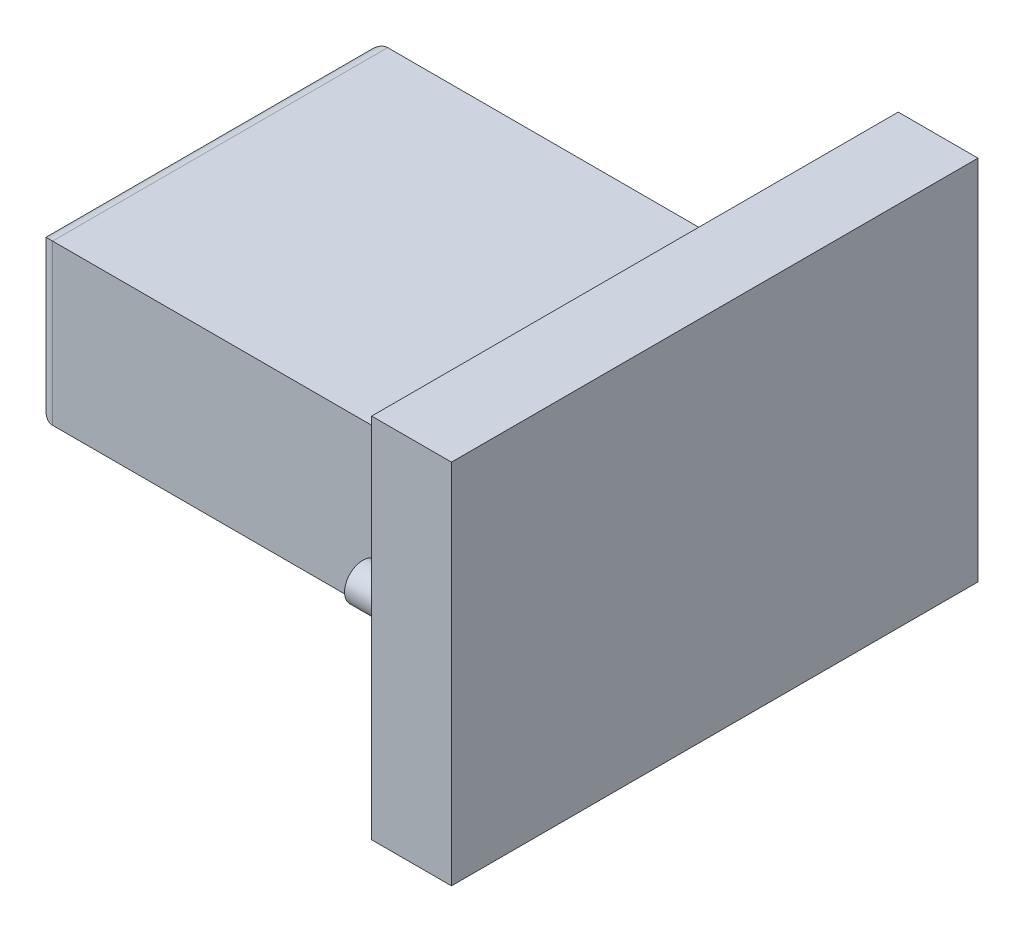
ISO-10303-21;
HEADER;
FILE_DESCRIPTION(('STEP AP214'),'2;1');
FILE_NAME('part.step','',(''),(''),'','','');
FILE_SCHEMA(('AUTOMOTIVE_DESIGN { 1 0 10303 214 1 1 1 1 }'));
ENDSEC;
DATA;
#1=APPLICATION_CONTEXT('core data for automotive mechanical design processes');
#2=APPLICATION_PROTOCOL_DEFINITION('international standard','automotive_design',2000,#1);
#3=PRODUCT_CONTEXT('',#1,'mechanical');
#4=PRODUCT('Part','Part','',(#3));
#5=PRODUCT_RELATED_PRODUCT_CATEGORY('part','',(#4));
#6=PRODUCT_DEFINITION_FORMATION('','',#4);
#7=PRODUCT_DEFINITION_CONTEXT('part definition',#1,'design');
#8=PRODUCT_DEFINITION('design','',#6,#7);
#9=PRODUCT_DEFINITION_SHAPE('','',#8);
#10=(LENGTH_UNIT() NAMED_UNIT(*) SI_UNIT(.MILLI.,.METRE.));
#11=(NAMED_UNIT(*) PLANE_ANGLE_UNIT() SI_UNIT($,.RADIAN.));
#12=(NAMED_UNIT(*) SI_UNIT($,.STERADIAN.) SOLID_ANGLE_UNIT());
#13=UNCERTAINTY_MEASURE_WITH_UNIT(LENGTH_MEASURE(1.E-05),#10,'distance_accuracy_value','');
#14=(GEOMETRIC_REPRESENTATION_CONTEXT(3) GLOBAL_UNCERTAINTY_ASSIGNED_CONTEXT((#13)) GLOBAL_UNIT_ASSIGNED_CONTEXT((#10,
#11,#12)) REPRESENTATION_CONTEXT('',''));
#15=CARTESIAN_POINT('',(0.,0.,0.));
#16=DIRECTION('',(0.,0.,1.));
#17=DIRECTION('',(1.,0.,0.));
#18=AXIS2_PLACEMENT_3D('',#15,#16,#17);
#19=CARTESIAN_POINT('',(5.,0.,0.));
#20=DIRECTION('',(0.,0.,-1.));
#21=DIRECTION('',(-1.,0.,0.));
#22=AXIS2_PLACEMENT_3D('',#19,#20,#21);
#23=PLANE('',#22);
#24=DIRECTION('',(0.,-1.,0.));
#25=VECTOR('',#24,1.);
#26=CARTESIAN_POINT('',(0.,0.,0.));
#27=LINE('',#26,#25);
#28=CARTESIAN_POINT('',(0.,23.,0.));
#29=VERTEX_POINT('',#28);
#30=CARTESIAN_POINT('',(0.,0.,0.));
#31=VERTEX_POINT('',#30);
#32=EDGE_CURVE('E152',#29,#31,#27,.T.);
#33=ORIENTED_EDGE('',*,*,#32,.T.);
#34=DIRECTION('',(-1.,0.,0.));
#35=VECTOR('',#34,1.);
#36=CARTESIAN_POINT('',(5.,0.,0.));
#37=LINE('',#36,#35);
#38=CARTESIAN_POINT('',(5.,0.,0.));
#39=VERTEX_POINT('',#38);
#40=EDGE_CURVE('E179',#39,#31,#37,.T.);
#41=ORIENTED_EDGE('',*,*,#40,.F.);
#42=DIRECTION('',(0.,-1.,0.));
#43=VECTOR('',#42,1.);
#44=CARTESIAN_POINT('',(5.,0.,0.));
#45=LINE('',#44,#43);
#46=CARTESIAN_POINT('',(5.,23.,0.));
#47=VERTEX_POINT('',#46);
#48=EDGE_CURVE('E153',#47,#39,#45,.T.);
#49=ORIENTED_EDGE('',*,*,#48,.F.);
#50=DIRECTION('',(-1.,0.,0.));
#51=VECTOR('',#50,1.);
#52=CARTESIAN_POINT('',(5.,23.,0.));
#53=LINE('',#52,#51);
#54=EDGE_CURVE('E163',#47,#29,#53,.T.);
#55=ORIENTED_EDGE('',*,*,#54,.T.);
#56=EDGE_LOOP('',(#33,#41,#49,#55));
#57=FACE_BOUND('',#56,.T.);
#58=ADVANCED_FACE('F45',(#57),#23,.F.);
#59=CARTESIAN_POINT('',(5.,0.,0.));
#60=DIRECTION('',(0.,1.,0.));
#61=DIRECTION('',(0.,0.,1.));
#62=AXIS2_PLACEMENT_3D('',#59,#60,#61);
#63=PLANE('',#62);
#64=DIRECTION('',(0.,0.,-1.));
#65=VECTOR('',#64,1.);
#66=CARTESIAN_POINT('',(0.,0.,0.));
#67=LINE('',#66,#65);
#68=CARTESIAN_POINT('',(0.,0.,-33.));
#69=VERTEX_POINT('',#68);
#70=EDGE_CURVE('E166',#31,#69,#67,.T.);
#71=ORIENTED_EDGE('',*,*,#70,.T.);
#72=DIRECTION('',(-1.,0.,0.));
#73=VECTOR('',#72,1.);
#74=CARTESIAN_POINT('',(5.,0.,-33.));
#75=LINE('',#74,#73);
#76=CARTESIAN_POINT('',(5.,0.,-33.));
#77=VERTEX_POINT('',#76);
#78=EDGE_CURVE('E176',#77,#69,#75,.T.);
#79=ORIENTED_EDGE('',*,*,#78,.F.);
#80=DIRECTION('',(0.,0.,-1.));
#81=VECTOR('',#80,1.);
#82=CARTESIAN_POINT('',(5.,0.,0.));
#83=LINE('',#82,#81);
#84=EDGE_CURVE('E156',#39,#77,#83,.T.);
#85=ORIENTED_EDGE('',*,*,#84,.F.);
#86=ORIENTED_EDGE('',*,*,#40,.T.);
#87=EDGE_LOOP('',(#71,#79,#85,#86));
#88=FACE_BOUND('',#87,.T.);
#89=ADVANCED_FACE('F253',(#88),#63,.F.);
#90=CARTESIAN_POINT('',(5.,0.,-33.));
#91=DIRECTION('',(0.,0.,1.));
#92=DIRECTION('',(1.,0.,0.));
#93=AXIS2_PLACEMENT_3D('',#90,#91,#92);
#94=PLANE('',#93);
#95=DIRECTION('',(0.,1.,0.));
#96=VECTOR('',#95,1.);
#97=CARTESIAN_POINT('',(0.,0.,-33.));
#98=LINE('',#97,#96);
#99=CARTESIAN_POINT('',(0.,23.,-33.));
#100=VERTEX_POINT('',#99);
#101=EDGE_CURVE('E168',#69,#100,#98,.T.);
#102=ORIENTED_EDGE('',*,*,#101,.T.);
#103=DIRECTION('',(-1.,0.,0.));
#104=VECTOR('',#103,1.);
#105=CARTESIAN_POINT('',(5.,23.,-33.));
#106=LINE('',#105,#104);
#107=CARTESIAN_POINT('',(5.,23.,-33.));
#108=VERTEX_POINT('',#107);
#109=EDGE_CURVE('E173',#108,#100,#106,.T.);
#110=ORIENTED_EDGE('',*,*,#109,.F.);
#111=DIRECTION('',(0.,1.,0.));
#112=VECTOR('',#111,1.);
#113=CARTESIAN_POINT('',(5.,0.,-33.));
#114=LINE('',#113,#112);
#115=EDGE_CURVE('E159',#77,#108,#114,.T.);
#116=ORIENTED_EDGE('',*,*,#115,.F.);
#117=ORIENTED_EDGE('',*,*,#78,.T.);
#118=EDGE_LOOP('',(#102,#110,#116,#117));
#119=FACE_BOUND('',#118,.T.);
#120=ADVANCED_FACE('F259',(#119),#94,.F.);
#121=CARTESIAN_POINT('',(5.,23.,0.));
#122=DIRECTION('',(0.,-1.,0.));
#123=DIRECTION('',(0.,0.,-1.));
#124=AXIS2_PLACEMENT_3D('',#121,#122,#123);
#125=PLANE('',#124);
#126=DIRECTION('',(0.,0.,1.));
#127=VECTOR('',#126,1.);
#128=CARTESIAN_POINT('',(0.,23.,0.));
#129=LINE('',#128,#127);
#130=EDGE_CURVE('E157',#100,#29,#129,.T.);
#131=ORIENTED_EDGE('',*,*,#130,.T.);
#132=ORIENTED_EDGE('',*,*,#54,.F.);
#133=DIRECTION('',(0.,0.,1.));
#134=VECTOR('',#133,1.);
#135=CARTESIAN_POINT('',(5.,23.,0.));
#136=LINE('',#135,#134);
#137=EDGE_CURVE('E161',#108,#47,#136,.T.);
#138=ORIENTED_EDGE('',*,*,#137,.F.);
#139=ORIENTED_EDGE('',*,*,#109,.T.);
#140=EDGE_LOOP('',(#131,#132,#138,#139));
#141=FACE_BOUND('',#140,.T.);
#142=ADVANCED_FACE('F308',(#141),#125,.F.);
#143=CARTESIAN_POINT('',(5.,0.,0.));
#144=DIRECTION('',(-1.,0.,0.));
#145=DIRECTION('',(0.,0.,1.));
#146=AXIS2_PLACEMENT_3D('',#143,#144,#145);
#147=PLANE('',#146);
#148=ORIENTED_EDGE('',*,*,#48,.T.);
#149=ORIENTED_EDGE('',*,*,#84,.T.);
#150=ORIENTED_EDGE('',*,*,#115,.T.);
#151=ORIENTED_EDGE('',*,*,#137,.T.);
#152=EDGE_LOOP('',(#148,#149,#150,#151));
#153=FACE_BOUND('',#152,.T.);
#154=ADVANCED_FACE('F305',(#153),#147,.F.);
#155=CARTESIAN_POINT('',(0.,0.,0.));
#156=DIRECTION('',(-1.,0.,0.));
#157=DIRECTION('',(0.,0.,1.));
#158=AXIS2_PLACEMENT_3D('',#155,#156,#157);
#159=PLANE('',#158);
#160=CARTESIAN_POINT('',(0.,11.5,-30.75));
#161=DIRECTION('',(-1.,0.,0.));
#162=DIRECTION('',(0.,0.,1.));
#163=AXIS2_PLACEMENT_3D('',#160,#161,#162);
#164=CIRCLE('',#163,1.4);
#165=CARTESIAN_POINT('',(0.,11.5,-29.35));
#166=VERTEX_POINT('',#165);
#167=EDGE_CURVE('E53',#166,#166,#164,.F.);
#168=ORIENTED_EDGE('',*,*,#167,.T.);
#169=EDGE_LOOP('',(#168));
#170=FACE_BOUND('',#169,.T.);
#171=CARTESIAN_POINT('',(0.,11.5,-2.25));
#172=DIRECTION('',(-1.,0.,0.));
#173=DIRECTION('',(0.,0.,1.));
#174=AXIS2_PLACEMENT_3D('',#171,#172,#173);
#175=CIRCLE('',#174,1.4);
#176=CARTESIAN_POINT('',(0.,11.5,-0.850000000000001));
#177=VERTEX_POINT('',#176);
#178=EDGE_CURVE('E211',#177,#177,#175,.F.);
#179=ORIENTED_EDGE('',*,*,#178,.T.);
#180=EDGE_LOOP('',(#179));
#181=FACE_BOUND('',#180,.T.);
#182=DIRECTION('',(0.,-1.,0.));
#183=VECTOR('',#182,1.);
#184=CARTESIAN_POINT('',(0.,6.5,-27.));
#185=LINE('',#184,#183);
#186=CARTESIAN_POINT('',(0.,16.5,-27.));
#187=VERTEX_POINT('',#186);
#188=CARTESIAN_POINT('',(0.,6.5,-27.));
#189=VERTEX_POINT('',#188);
#190=EDGE_CURVE('E141',#187,#189,#185,.T.);
#191=ORIENTED_EDGE('',*,*,#190,.F.);
#192=DIRECTION('',(0.,0.,-1.));
#193=VECTOR('',#192,1.);
#194=CARTESIAN_POINT('',(0.,16.5,-27.));
#195=LINE('',#194,#193);
#196=CARTESIAN_POINT('',(0.,16.5,-6.));
#197=VERTEX_POINT('',#196);
#198=EDGE_CURVE('E138',#197,#187,#195,.T.);
#199=ORIENTED_EDGE('',*,*,#198,.F.);
#200=DIRECTION('',(0.,1.,0.));
#201=VECTOR('',#200,1.);
#202=CARTESIAN_POINT('',(0.,6.5,-6.));
#203=LINE('',#202,#201);
#204=CARTESIAN_POINT('',(0.,6.5,-6.));
#205=VERTEX_POINT('',#204);
#206=EDGE_CURVE('E124',#205,#197,#203,.T.);
#207=ORIENTED_EDGE('',*,*,#206,.F.);
#208=DIRECTION('',(0.,0.,1.));
#209=VECTOR('',#208,1.);
#210=CARTESIAN_POINT('',(0.,6.5,-27.));
#211=LINE('',#210,#209);
#212=EDGE_CURVE('E135',#189,#205,#211,.T.);
#213=ORIENTED_EDGE('',*,*,#212,.F.);
#214=EDGE_LOOP('',(#191,#199,#207,#213));
#215=FACE_BOUND('',#214,.T.);
#216=ORIENTED_EDGE('',*,*,#32,.F.);
#217=ORIENTED_EDGE('',*,*,#130,.F.);
#218=ORIENTED_EDGE('',*,*,#101,.F.);
#219=ORIENTED_EDGE('',*,*,#70,.F.);
#220=EDGE_LOOP('',(#216,#217,#218,#219));
#221=FACE_BOUND('',#220,.T.);
#222=ADVANCED_FACE('F133',(#170,#181,#215,#221),#159,.T.);
#223=CARTESIAN_POINT('',(-27.,6.5,-27.));
#224=DIRECTION('',(0.,0.,1.));
#225=DIRECTION('',(1.,0.,0.));
#226=AXIS2_PLACEMENT_3D('',#223,#224,#225);
#227=PLANE('',#226);
#228=DIRECTION('',(1.,0.,0.));
#229=VECTOR('',#228,1.);
#230=CARTESIAN_POINT('',(-27.,6.5,-27.));
#231=LINE('',#230,#229);
#232=CARTESIAN_POINT('',(-26.,6.5,-27.));
#233=VERTEX_POINT('',#232);
#234=EDGE_CURVE('E126',#233,#189,#231,.T.);
#235=ORIENTED_EDGE('',*,*,#234,.F.);
#236=DIRECTION('',(0.,-1.,0.));
#237=VECTOR('',#236,1.);
#238=CARTESIAN_POINT('',(-26.,6.5,-27.));
#239=LINE('',#238,#237);
#240=CARTESIAN_POINT('',(-26.,16.5,-27.));
#241=VERTEX_POINT('',#240);
#242=EDGE_CURVE('E196',#233,#241,#239,.F.);
#243=ORIENTED_EDGE('',*,*,#242,.T.);
#244=DIRECTION('',(1.,0.,0.));
#245=VECTOR('',#244,1.);
#246=CARTESIAN_POINT('',(-27.,16.5,-27.));
#247=LINE('',#246,#245);
#248=EDGE_CURVE('E148',#241,#187,#247,.T.);
#249=ORIENTED_EDGE('',*,*,#248,.T.);
#250=ORIENTED_EDGE('',*,*,#190,.T.);
#251=EDGE_LOOP('',(#235,#243,#249,#250));
#252=FACE_BOUND('',#251,.T.);
#253=ADVANCED_FACE('F288',(#252),#227,.F.);
#254=CARTESIAN_POINT('',(-27.,6.5,-27.));
#255=DIRECTION('',(0.,1.,0.));
#256=DIRECTION('',(0.,0.,1.));
#257=AXIS2_PLACEMENT_3D('',#254,#255,#256);
#258=PLANE('',#257);
#259=DIRECTION('',(1.,0.,0.));
#260=VECTOR('',#259,1.);
#261=CARTESIAN_POINT('',(-27.,6.5,-6.));
#262=LINE('',#261,#260);
#263=CARTESIAN_POINT('',(-26.,6.5,-6.));
#264=VERTEX_POINT('',#263);
#265=EDGE_CURVE('E121',#264,#205,#262,.T.);
#266=ORIENTED_EDGE('',*,*,#265,.F.);
#267=DIRECTION('',(0.,0.,1.));
#268=VECTOR('',#267,1.);
#269=CARTESIAN_POINT('',(-26.,6.5,-27.));
#270=LINE('',#269,#268);
#271=EDGE_CURVE('E60',#264,#233,#270,.F.);
#272=ORIENTED_EDGE('',*,*,#271,.T.);
#273=ORIENTED_EDGE('',*,*,#234,.T.);
#274=ORIENTED_EDGE('',*,*,#212,.T.);
#275=EDGE_LOOP('',(#266,#272,#273,#274));
#276=FACE_BOUND('',#275,.T.);
#277=ADVANCED_FACE('F140',(#276),#258,.F.);
#278=CARTESIAN_POINT('',(-27.,6.5,-6.));
#279=DIRECTION('',(0.,0.,-1.));
#280=DIRECTION('',(-1.,0.,0.));
#281=AXIS2_PLACEMENT_3D('',#278,#279,#280);
#282=PLANE('',#281);
#283=DIRECTION('',(1.,0.,0.));
#284=VECTOR('',#283,1.);
#285=CARTESIAN_POINT('',(-27.,16.5,-6.));
#286=LINE('',#285,#284);
#287=CARTESIAN_POINT('',(-26.,16.5,-6.));
#288=VERTEX_POINT('',#287);
#289=EDGE_CURVE('E127',#288,#197,#286,.T.);
#290=ORIENTED_EDGE('',*,*,#289,.F.);
#291=DIRECTION('',(0.,1.,0.));
#292=VECTOR('',#291,1.);
#293=CARTESIAN_POINT('',(-26.,6.5,-6.));
#294=LINE('',#293,#292);
#295=EDGE_CURVE('E68',#288,#264,#294,.F.);
#296=ORIENTED_EDGE('',*,*,#295,.T.);
#297=ORIENTED_EDGE('',*,*,#265,.T.);
#298=ORIENTED_EDGE('',*,*,#206,.T.);
#299=EDGE_LOOP('',(#290,#296,#297,#298));
#300=FACE_BOUND('',#299,.T.);
#301=ADVANCED_FACE('F123',(#300),#282,.F.);
#302=CARTESIAN_POINT('',(-27.,16.5,-27.));
#303=DIRECTION('',(0.,-1.,0.));
#304=DIRECTION('',(0.,0.,-1.));
#305=AXIS2_PLACEMENT_3D('',#302,#303,#304);
#306=PLANE('',#305);
#307=ORIENTED_EDGE('',*,*,#248,.F.);
#308=DIRECTION('',(0.,0.,-1.));
#309=VECTOR('',#308,1.);
#310=CARTESIAN_POINT('',(-26.,16.5,-27.));
#311=LINE('',#310,#309);
#312=EDGE_CURVE('E191',#241,#288,#311,.F.);
#313=ORIENTED_EDGE('',*,*,#312,.T.);
#314=ORIENTED_EDGE('',*,*,#289,.T.);
#315=ORIENTED_EDGE('',*,*,#198,.T.);
#316=EDGE_LOOP('',(#307,#313,#314,#315));
#317=FACE_BOUND('',#316,.T.);
#318=ADVANCED_FACE('F278',(#317),#306,.F.);
#319=CARTESIAN_POINT('',(-27.,0.,0.));
#320=DIRECTION('',(1.,0.,0.));
#321=DIRECTION('',(0.,0.,-1.));
#322=AXIS2_PLACEMENT_3D('',#319,#320,#321);
#323=PLANE('',#322);
#324=DIRECTION('',(0.,1.,0.));
#325=VECTOR('',#324,1.);
#326=CARTESIAN_POINT('',(-27.,0.,-7.));
#327=LINE('',#326,#325);
#328=CARTESIAN_POINT('',(-27.,7.5,-7.));
#329=VERTEX_POINT('',#328);
#330=CARTESIAN_POINT('',(-27.,15.5,-7.));
#331=VERTEX_POINT('',#330);
#332=EDGE_CURVE('E186',#329,#331,#327,.T.);
#333=ORIENTED_EDGE('',*,*,#332,.T.);
#334=DIRECTION('',(0.,0.,-1.));
#335=VECTOR('',#334,1.);
#336=CARTESIAN_POINT('',(-27.,15.5,0.));
#337=LINE('',#336,#335);
#338=CARTESIAN_POINT('',(-27.,15.5,-26.));
#339=VERTEX_POINT('',#338);
#340=EDGE_CURVE('E188',#331,#339,#337,.T.);
#341=ORIENTED_EDGE('',*,*,#340,.T.);
#342=DIRECTION('',(0.,-1.,0.));
#343=VECTOR('',#342,1.);
#344=CARTESIAN_POINT('',(-27.,0.,-26.));
#345=LINE('',#344,#343);
#346=CARTESIAN_POINT('',(-27.,7.5,-26.));
#347=VERTEX_POINT('',#346);
#348=EDGE_CURVE('E182',#339,#347,#345,.T.);
#349=ORIENTED_EDGE('',*,*,#348,.T.);
#350=DIRECTION('',(0.,0.,1.));
#351=VECTOR('',#350,1.);
#352=CARTESIAN_POINT('',(-27.,7.5,0.));
#353=LINE('',#352,#351);
#354=EDGE_CURVE('E184',#347,#329,#353,.T.);
#355=ORIENTED_EDGE('',*,*,#354,.T.);
#356=EDGE_LOOP('',(#333,#341,#349,#355));
#357=FACE_BOUND('',#356,.T.);
#358=ADVANCED_FACE('F273',(#357),#323,.F.);
#359=CARTESIAN_POINT('',(-26.,7.5,0.));
#360=DIRECTION('',(0.,0.,1.));
#361=DIRECTION('',(1.,0.,0.));
#362=AXIS2_PLACEMENT_3D('',#359,#360,#361);
#363=CYLINDRICAL_SURFACE('',#362,1.);
#364=CARTESIAN_POINT('',(-26.,7.5,-26.));
#365=DIRECTION('',(0.,-0.707106781186547,0.707106781186547));
#366=DIRECTION('',(0.,-0.707106781186547,-0.707106781186547));
#367=AXIS2_PLACEMENT_3D('',#364,#365,#366);
#368=ELLIPSE('',#367,1.41421356237309,1.);
#369=EDGE_CURVE('E204',#233,#347,#368,.F.);
#370=ORIENTED_EDGE('',*,*,#369,.F.);
#371=ORIENTED_EDGE('',*,*,#271,.F.);
#372=CARTESIAN_POINT('',(-26.,7.5,-7.));
#373=DIRECTION('',(0.,0.707106781186547,0.707106781186547));
#374=DIRECTION('',(0.,-0.707106781186547,0.707106781186547));
#375=AXIS2_PLACEMENT_3D('',#372,#373,#374);
#376=ELLIPSE('',#375,1.41421356237309,1.);
#377=EDGE_CURVE('E143',#329,#264,#376,.T.);
#378=ORIENTED_EDGE('',*,*,#377,.F.);
#379=ORIENTED_EDGE('',*,*,#354,.F.);
#380=EDGE_LOOP('',(#370,#371,#378,#379));
#381=FACE_BOUND('',#380,.T.);
#382=ADVANCED_FACE('F270',(#381),#363,.T.);
#383=CARTESIAN_POINT('',(-26.,0.,-7.));
#384=DIRECTION('',(0.,1.,0.));
#385=DIRECTION('',(0.,0.,1.));
#386=AXIS2_PLACEMENT_3D('',#383,#384,#385);
#387=CYLINDRICAL_SURFACE('',#386,1.);
#388=ORIENTED_EDGE('',*,*,#377,.T.);
#389=ORIENTED_EDGE('',*,*,#295,.F.);
#390=CARTESIAN_POINT('',(-26.,15.5,-7.));
#391=DIRECTION('',(0.,0.707106781186547,-0.707106781186547));
#392=DIRECTION('',(0.,0.707106781186547,0.707106781186547));
#393=AXIS2_PLACEMENT_3D('',#390,#391,#392);
#394=ELLIPSE('',#393,1.41421356237309,1.);
#395=EDGE_CURVE('E201',#331,#288,#394,.T.);
#396=ORIENTED_EDGE('',*,*,#395,.F.);
#397=ORIENTED_EDGE('',*,*,#332,.F.);
#398=EDGE_LOOP('',(#388,#389,#396,#397));
#399=FACE_BOUND('',#398,.T.);
#400=ADVANCED_FACE('F266',(#399),#387,.T.);
#401=CARTESIAN_POINT('',(-26.,0.,-26.));
#402=DIRECTION('',(0.,-1.,0.));
#403=DIRECTION('',(0.,0.,-1.));
#404=AXIS2_PLACEMENT_3D('',#401,#402,#403);
#405=CYLINDRICAL_SURFACE('',#404,1.);
#406=ORIENTED_EDGE('',*,*,#369,.T.);
#407=ORIENTED_EDGE('',*,*,#348,.F.);
#408=CARTESIAN_POINT('',(-26.,15.5,-26.));
#409=DIRECTION('',(0.,-0.707106781186547,-0.707106781186547));
#410=DIRECTION('',(0.,-0.707106781186547,0.707106781186547));
#411=AXIS2_PLACEMENT_3D('',#408,#409,#410);
#412=ELLIPSE('',#411,1.41421356237309,1.);
#413=EDGE_CURVE('E199',#241,#339,#412,.F.);
#414=ORIENTED_EDGE('',*,*,#413,.F.);
#415=ORIENTED_EDGE('',*,*,#242,.F.);
#416=EDGE_LOOP('',(#406,#407,#414,#415));
#417=FACE_BOUND('',#416,.T.);
#418=ADVANCED_FACE('F248',(#417),#405,.T.);
#419=CARTESIAN_POINT('',(-26.,15.5,0.));
#420=DIRECTION('',(0.,0.,-1.));
#421=DIRECTION('',(-1.,0.,0.));
#422=AXIS2_PLACEMENT_3D('',#419,#420,#421);
#423=CYLINDRICAL_SURFACE('',#422,1.);
#424=ORIENTED_EDGE('',*,*,#395,.T.);
#425=ORIENTED_EDGE('',*,*,#312,.F.);
#426=ORIENTED_EDGE('',*,*,#413,.T.);
#427=ORIENTED_EDGE('',*,*,#340,.F.);
#428=EDGE_LOOP('',(#424,#425,#426,#427));
#429=FACE_BOUND('',#428,.T.);
#430=ADVANCED_FACE('F240',(#429),#423,.T.);
#431=CARTESIAN_POINT('',(-2.8,11.5,-2.25));
#432=DIRECTION('',(1.,0.,0.));
#433=DIRECTION('',(0.,0.,-1.));
#434=AXIS2_PLACEMENT_3D('',#431,#432,#433);
#435=CYLINDRICAL_SURFACE('',#434,1.15);
#436=CARTESIAN_POINT('',(-0.25,11.5,-2.25));
#437=DIRECTION('',(-1.,0.,0.));
#438=DIRECTION('',(0.,0.,1.));
#439=AXIS2_PLACEMENT_3D('',#436,#437,#438);
#440=CIRCLE('',#439,1.15);
#441=CARTESIAN_POINT('',(-0.25,11.5,-1.1));
#442=VERTEX_POINT('',#441);
#443=EDGE_CURVE('E13',#442,#442,#440,.T.);
#444=ORIENTED_EDGE('',*,*,#443,.T.);
#445=EDGE_LOOP('',(#444));
#446=FACE_BOUND('',#445,.T.);
#447=CARTESIAN_POINT('',(-2.8,11.5,-2.25));
#448=DIRECTION('',(-1.,0.,0.));
#449=DIRECTION('',(0.,0.,1.));
#450=AXIS2_PLACEMENT_3D('',#447,#448,#449);
#451=CIRCLE('',#450,1.15);
#452=CARTESIAN_POINT('',(-2.8,11.5,-1.1));
#453=VERTEX_POINT('',#452);
#454=EDGE_CURVE('E202',#453,#453,#451,.T.);
#455=ORIENTED_EDGE('',*,*,#454,.F.);
#456=EDGE_LOOP('',(#455));
#457=FACE_BOUND('',#456,.T.);
#458=ADVANCED_FACE('F238',(#446,#457),#435,.T.);
#459=CARTESIAN_POINT('',(-2.8,11.5,-2.25));
#460=DIRECTION('',(-1.,0.,0.));
#461=DIRECTION('',(0.,0.,1.));
#462=AXIS2_PLACEMENT_3D('',#459,#460,#461);
#463=PLANE('',#462);
#464=ORIENTED_EDGE('',*,*,#454,.T.);
#465=EDGE_LOOP('',(#464));
#466=FACE_BOUND('',#465,.T.);
#467=ADVANCED_FACE('F227',(#466),#463,.T.);
#468=CARTESIAN_POINT('',(-2.8,11.5,-30.75));
#469=DIRECTION('',(1.,0.,0.));
#470=DIRECTION('',(0.,0.,-1.));
#471=AXIS2_PLACEMENT_3D('',#468,#469,#470);
#472=CYLINDRICAL_SURFACE('',#471,1.15);
#473=CARTESIAN_POINT('',(-0.25,11.5,-30.75));
#474=DIRECTION('',(-1.,0.,0.));
#475=DIRECTION('',(0.,0.,1.));
#476=AXIS2_PLACEMENT_3D('',#473,#474,#475);
#477=CIRCLE('',#476,1.15);
#478=CARTESIAN_POINT('',(-0.25,11.5,-29.6));
#479=VERTEX_POINT('',#478);
#480=EDGE_CURVE('E198',#479,#479,#477,.T.);
#481=ORIENTED_EDGE('',*,*,#480,.T.);
#482=EDGE_LOOP('',(#481));
#483=FACE_BOUND('',#482,.T.);
#484=CARTESIAN_POINT('',(-2.8,11.5,-30.75));
#485=DIRECTION('',(-1.,0.,0.));
#486=DIRECTION('',(0.,0.,1.));
#487=AXIS2_PLACEMENT_3D('',#484,#485,#486);
#488=CIRCLE('',#487,1.15);
#489=CARTESIAN_POINT('',(-2.8,11.5,-29.6));
#490=VERTEX_POINT('',#489);
#491=EDGE_CURVE('E231',#490,#490,#488,.T.);
#492=ORIENTED_EDGE('',*,*,#491,.F.);
#493=EDGE_LOOP('',(#492));
#494=FACE_BOUND('',#493,.T.);
#495=ADVANCED_FACE('F224',(#483,#494),#472,.T.);
#496=CARTESIAN_POINT('',(-2.8,11.5,-30.75));
#497=DIRECTION('',(-1.,0.,0.));
#498=DIRECTION('',(0.,0.,1.));
#499=AXIS2_PLACEMENT_3D('',#496,#497,#498);
#500=PLANE('',#499);
#501=ORIENTED_EDGE('',*,*,#491,.T.);
#502=EDGE_LOOP('',(#501));
#503=FACE_BOUND('',#502,.T.);
#504=ADVANCED_FACE('F221',(#503),#500,.T.);
#505=CARTESIAN_POINT('',(-0.25,11.5,-30.75));
#506=DIRECTION('',(-1.,0.,0.));
#507=DIRECTION('',(0.,0.,1.));
#508=AXIS2_PLACEMENT_3D('',#505,#506,#507);
#509=TOROIDAL_SURFACE('',#508,1.4,0.25);
#510=ORIENTED_EDGE('',*,*,#167,.F.);
#511=EDGE_LOOP('',(#510));
#512=FACE_BOUND('',#511,.T.);
#513=ORIENTED_EDGE('',*,*,#480,.F.);
#514=EDGE_LOOP('',(#513));
#515=FACE_BOUND('',#514,.T.);
#516=ADVANCED_FACE('F218',(#512,#515),#509,.F.);
#517=CARTESIAN_POINT('',(-0.25,11.5,-2.25));
#518=DIRECTION('',(-1.,0.,0.));
#519=DIRECTION('',(0.,0.,1.));
#520=AXIS2_PLACEMENT_3D('',#517,#518,#519);
#521=TOROIDAL_SURFACE('',#520,1.4,0.25);
#522=ORIENTED_EDGE('',*,*,#178,.F.);
#523=EDGE_LOOP('',(#522));
#524=FACE_BOUND('',#523,.T.);
#525=ORIENTED_EDGE('',*,*,#443,.F.);
#526=EDGE_LOOP('',(#525));
#527=FACE_BOUND('',#526,.T.);
#528=ADVANCED_FACE('F47',(#524,#527),#521,.F.);
#529=CLOSED_SHELL('',(#58,#89,#120,#142,#154,#222,#253,#277,#301,#318,#358,#382,#400,#418,#430,
#458,#467,#495,#504,#516,#528));
#530=MANIFOLD_SOLID_BREP('B2',#529);
#531=ADVANCED_BREP_SHAPE_REPRESENTATION('',(#18,#530),#14);
#532=SHAPE_DEFINITION_REPRESENTATION(#9,#531);
ENDSEC;
END-ISO-10303-21;
